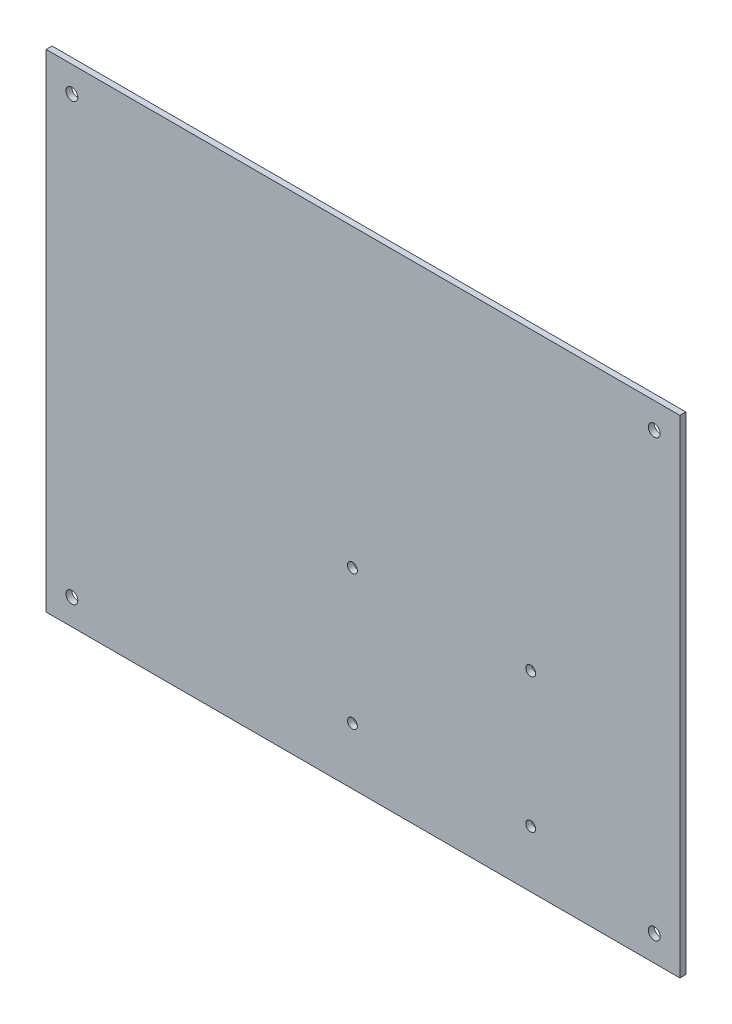
ISO-10303-21;
HEADER;
FILE_DESCRIPTION(('STEP AP214'),'2;1');
FILE_NAME('part.step','',(''),(''),'','','');
FILE_SCHEMA(('AUTOMOTIVE_DESIGN { 1 0 10303 214 1 1 1 1 }'));
ENDSEC;
DATA;
#1=APPLICATION_CONTEXT('core data for automotive mechanical design processes');
#2=APPLICATION_PROTOCOL_DEFINITION('international standard','automotive_design',2000,#1);
#3=PRODUCT_CONTEXT('',#1,'mechanical');
#4=PRODUCT('Part','Part','',(#3));
#5=PRODUCT_RELATED_PRODUCT_CATEGORY('part','',(#4));
#6=PRODUCT_DEFINITION_FORMATION('','',#4);
#7=PRODUCT_DEFINITION_CONTEXT('part definition',#1,'design');
#8=PRODUCT_DEFINITION('design','',#6,#7);
#9=PRODUCT_DEFINITION_SHAPE('','',#8);
#10=(LENGTH_UNIT() NAMED_UNIT(*) SI_UNIT(.MILLI.,.METRE.));
#11=(NAMED_UNIT(*) PLANE_ANGLE_UNIT() SI_UNIT($,.RADIAN.));
#12=(NAMED_UNIT(*) SI_UNIT($,.STERADIAN.) SOLID_ANGLE_UNIT());
#13=UNCERTAINTY_MEASURE_WITH_UNIT(LENGTH_MEASURE(1.E-05),#10,'distance_accuracy_value','');
#14=(GEOMETRIC_REPRESENTATION_CONTEXT(3) GLOBAL_UNCERTAINTY_ASSIGNED_CONTEXT((#13)) GLOBAL_UNIT_ASSIGNED_CONTEXT((#10,
#11,#12)) REPRESENTATION_CONTEXT('',''));
#15=CARTESIAN_POINT('',(0.,0.,0.));
#16=DIRECTION('',(0.,0.,1.));
#17=DIRECTION('',(1.,0.,0.));
#18=AXIS2_PLACEMENT_3D('',#15,#16,#17);
#19=CARTESIAN_POINT('',(1037.34751782577,-1519.02260067621,2.25));
#20=DIRECTION('',(0.,0.,1.));
#21=DIRECTION('',(1.,0.,0.));
#22=AXIS2_PLACEMENT_3D('',#19,#20,#21);
#23=PLANE('',#22);
#24=CARTESIAN_POINT('',(1194.93385313975,-1700.96117964024,2.25));
#25=DIRECTION('',(0.,0.,1.));
#26=DIRECTION('',(1.,0.,0.));
#27=AXIS2_PLACEMENT_3D('',#24,#25,#26);
#28=CIRCLE('',#27,1.25000000000008);
#29=CARTESIAN_POINT('',(1196.18385313975,-1700.96117964024,2.25));
#30=VERTEX_POINT('',#29);
#31=EDGE_CURVE('E126',#30,#30,#28,.T.);
#32=ORIENTED_EDGE('',*,*,#31,.F.);
#33=EDGE_LOOP('',(#32));
#34=FACE_BOUND('',#33,.T.);
#35=CARTESIAN_POINT('',(1194.93385313975,-1734.96117964024,2.25));
#36=DIRECTION('',(0.,0.,1.));
#37=DIRECTION('',(1.,0.,0.));
#38=AXIS2_PLACEMENT_3D('',#35,#36,#37);
#39=CIRCLE('',#38,1.25000000000008);
#40=CARTESIAN_POINT('',(1196.18385313975,-1734.96117964024,2.25));
#41=VERTEX_POINT('',#40);
#42=EDGE_CURVE('E134',#41,#41,#39,.T.);
#43=ORIENTED_EDGE('',*,*,#42,.F.);
#44=EDGE_LOOP('',(#43));
#45=FACE_BOUND('',#44,.T.);
#46=CARTESIAN_POINT('',(1149.93385313975,-1734.96117964024,2.25));
#47=DIRECTION('',(0.,0.,1.));
#48=DIRECTION('',(1.,0.,0.));
#49=AXIS2_PLACEMENT_3D('',#46,#47,#48);
#50=CIRCLE('',#49,1.25000000000008);
#51=CARTESIAN_POINT('',(1151.18385313975,-1734.96117964024,2.25));
#52=VERTEX_POINT('',#51);
#53=EDGE_CURVE('E140',#52,#52,#50,.T.);
#54=ORIENTED_EDGE('',*,*,#53,.F.);
#55=EDGE_LOOP('',(#54));
#56=FACE_BOUND('',#55,.T.);
#57=CARTESIAN_POINT('',(1149.93385313975,-1700.96117964024,2.25));
#58=DIRECTION('',(0.,0.,1.));
#59=DIRECTION('',(1.,0.,0.));
#60=AXIS2_PLACEMENT_3D('',#57,#58,#59);
#61=CIRCLE('',#60,1.25000000000008);
#62=CARTESIAN_POINT('',(1151.18385313975,-1700.96117964024,2.25));
#63=VERTEX_POINT('',#62);
#64=EDGE_CURVE('E242',#63,#63,#61,.T.);
#65=ORIENTED_EDGE('',*,*,#64,.F.);
#66=EDGE_LOOP('',(#65));
#67=FACE_BOUND('',#66,.T.);
#68=CARTESIAN_POINT('',(1079.10835313975,-1742.80288964024,2.25));
#69=DIRECTION('',(0.,0.,1.));
#70=DIRECTION('',(1.,0.,0.));
#71=AXIS2_PLACEMENT_3D('',#68,#69,#70);
#72=CIRCLE('',#71,1.49999999999995);
#73=CARTESIAN_POINT('',(1080.60835313975,-1742.80288964024,2.25));
#74=VERTEX_POINT('',#73);
#75=EDGE_CURVE('E117',#74,#74,#72,.T.);
#76=ORIENTED_EDGE('',*,*,#75,.F.);
#77=EDGE_LOOP('',(#76));
#78=FACE_BOUND('',#77,.T.);
#79=CARTESIAN_POINT('',(1079.10835313975,-1632.80288964024,2.25));
#80=DIRECTION('',(0.,0.,1.));
#81=DIRECTION('',(1.,0.,0.));
#82=AXIS2_PLACEMENT_3D('',#79,#80,#81);
#83=CIRCLE('',#82,1.49999999999995);
#84=CARTESIAN_POINT('',(1080.60835313975,-1632.80288964024,2.25));
#85=VERTEX_POINT('',#84);
#86=EDGE_CURVE('E111',#85,#85,#83,.T.);
#87=ORIENTED_EDGE('',*,*,#86,.F.);
#88=EDGE_LOOP('',(#87));
#89=FACE_BOUND('',#88,.T.);
#90=DIRECTION('',(0.,-1.,0.));
#91=VECTOR('',#90,1.);
#92=CARTESIAN_POINT('',(1072.60835313975,-1626.30288964024,2.25));
#93=LINE('',#92,#91);
#94=CARTESIAN_POINT('',(1072.60835313975,-1626.30288964024,2.25));
#95=VERTEX_POINT('',#94);
#96=CARTESIAN_POINT('',(1072.60835313975,-1749.30288964024,2.25));
#97=VERTEX_POINT('',#96);
#98=EDGE_CURVE('E103',#95,#97,#93,.T.);
#99=ORIENTED_EDGE('',*,*,#98,.T.);
#100=DIRECTION('',(1.,0.,0.));
#101=VECTOR('',#100,1.);
#102=CARTESIAN_POINT('',(1072.60835313975,-1749.30288964024,2.25));
#103=LINE('',#102,#101);
#104=CARTESIAN_POINT('',(1232.60835313975,-1749.30288964024,2.25));
#105=VERTEX_POINT('',#104);
#106=EDGE_CURVE('E152',#97,#105,#103,.T.);
#107=ORIENTED_EDGE('',*,*,#106,.T.);
#108=DIRECTION('',(0.,1.,0.));
#109=VECTOR('',#108,1.);
#110=CARTESIAN_POINT('',(1232.60835313975,-1626.30288964024,2.25));
#111=LINE('',#110,#109);
#112=CARTESIAN_POINT('',(1232.60835313975,-1626.30288964024,2.25));
#113=VERTEX_POINT('',#112);
#114=EDGE_CURVE('E94',#105,#113,#111,.T.);
#115=ORIENTED_EDGE('',*,*,#114,.T.);
#116=DIRECTION('',(-1.,0.,0.));
#117=VECTOR('',#116,1.);
#118=CARTESIAN_POINT('',(1072.60835313975,-1626.30288964024,2.25));
#119=LINE('',#118,#117);
#120=EDGE_CURVE('E59',#113,#95,#119,.T.);
#121=ORIENTED_EDGE('',*,*,#120,.T.);
#122=EDGE_LOOP('',(#99,#107,#115,#121));
#123=FACE_BOUND('',#122,.T.);
#124=CARTESIAN_POINT('',(1226.10835313975,-1742.80288964024,2.25));
#125=DIRECTION('',(0.,0.,1.));
#126=DIRECTION('',(1.,0.,0.));
#127=AXIS2_PLACEMENT_3D('',#124,#125,#126);
#128=CIRCLE('',#127,1.50000000000006);
#129=CARTESIAN_POINT('',(1227.60835313975,-1742.80288964024,2.25));
#130=VERTEX_POINT('',#129);
#131=EDGE_CURVE('E112',#130,#130,#128,.T.);
#132=ORIENTED_EDGE('',*,*,#131,.F.);
#133=EDGE_LOOP('',(#132));
#134=FACE_BOUND('',#133,.T.);
#135=CARTESIAN_POINT('',(1226.10835313975,-1632.80288964024,2.25));
#136=DIRECTION('',(0.,0.,1.));
#137=DIRECTION('',(1.,0.,0.));
#138=AXIS2_PLACEMENT_3D('',#135,#136,#137);
#139=CIRCLE('',#138,1.50000000000006);
#140=CARTESIAN_POINT('',(1227.60835313975,-1632.80288964024,2.25));
#141=VERTEX_POINT('',#140);
#142=EDGE_CURVE('E122',#141,#141,#139,.T.);
#143=ORIENTED_EDGE('',*,*,#142,.F.);
#144=EDGE_LOOP('',(#143));
#145=FACE_BOUND('',#144,.T.);
#146=ADVANCED_FACE('F39',(#34,#45,#56,#67,#78,#89,#123,#134,#145),#23,.T.);
#147=CARTESIAN_POINT('',(1037.34751782577,-1519.02260067621,0.75));
#148=DIRECTION('',(0.,0.,1.));
#149=DIRECTION('',(1.,0.,0.));
#150=AXIS2_PLACEMENT_3D('',#147,#148,#149);
#151=PLANE('',#150);
#152=CARTESIAN_POINT('',(1194.93385313975,-1700.96117964024,0.75));
#153=DIRECTION('',(0.,0.,1.));
#154=DIRECTION('',(1.,0.,0.));
#155=AXIS2_PLACEMENT_3D('',#152,#153,#154);
#156=CIRCLE('',#155,1.25000000000008);
#157=CARTESIAN_POINT('',(1196.18385313975,-1700.96117964024,0.75));
#158=VERTEX_POINT('',#157);
#159=EDGE_CURVE('E245',#158,#158,#156,.T.);
#160=ORIENTED_EDGE('',*,*,#159,.T.);
#161=EDGE_LOOP('',(#160));
#162=FACE_BOUND('',#161,.T.);
#163=CARTESIAN_POINT('',(1194.93385313975,-1734.96117964024,0.75));
#164=DIRECTION('',(0.,0.,1.));
#165=DIRECTION('',(1.,0.,0.));
#166=AXIS2_PLACEMENT_3D('',#163,#164,#165);
#167=CIRCLE('',#166,1.25000000000008);
#168=CARTESIAN_POINT('',(1196.18385313975,-1734.96117964024,0.75));
#169=VERTEX_POINT('',#168);
#170=EDGE_CURVE('E237',#169,#169,#167,.T.);
#171=ORIENTED_EDGE('',*,*,#170,.T.);
#172=EDGE_LOOP('',(#171));
#173=FACE_BOUND('',#172,.T.);
#174=CARTESIAN_POINT('',(1149.93385313975,-1734.96117964024,0.75));
#175=DIRECTION('',(0.,0.,1.));
#176=DIRECTION('',(1.,0.,0.));
#177=AXIS2_PLACEMENT_3D('',#174,#175,#176);
#178=CIRCLE('',#177,1.25000000000008);
#179=CARTESIAN_POINT('',(1151.18385313975,-1734.96117964024,0.75));
#180=VERTEX_POINT('',#179);
#181=EDGE_CURVE('E233',#180,#180,#178,.T.);
#182=ORIENTED_EDGE('',*,*,#181,.T.);
#183=EDGE_LOOP('',(#182));
#184=FACE_BOUND('',#183,.T.);
#185=CARTESIAN_POINT('',(1149.93385313975,-1700.96117964024,0.75));
#186=DIRECTION('',(0.,0.,1.));
#187=DIRECTION('',(1.,0.,0.));
#188=AXIS2_PLACEMENT_3D('',#185,#186,#187);
#189=CIRCLE('',#188,1.25000000000008);
#190=CARTESIAN_POINT('',(1151.18385313975,-1700.96117964024,0.75));
#191=VERTEX_POINT('',#190);
#192=EDGE_CURVE('E236',#191,#191,#189,.T.);
#193=ORIENTED_EDGE('',*,*,#192,.T.);
#194=EDGE_LOOP('',(#193));
#195=FACE_BOUND('',#194,.T.);
#196=DIRECTION('',(0.,-1.,0.));
#197=VECTOR('',#196,1.);
#198=CARTESIAN_POINT('',(1072.60835313975,-1626.30288964024,0.75));
#199=LINE('',#198,#197);
#200=CARTESIAN_POINT('',(1072.60835313975,-1626.30288964024,0.75));
#201=VERTEX_POINT('',#200);
#202=CARTESIAN_POINT('',(1072.60835313975,-1749.30288964024,0.75));
#203=VERTEX_POINT('',#202);
#204=EDGE_CURVE('E88',#201,#203,#199,.T.);
#205=ORIENTED_EDGE('',*,*,#204,.F.);
#206=DIRECTION('',(-1.,0.,0.));
#207=VECTOR('',#206,1.);
#208=CARTESIAN_POINT('',(1072.60835313975,-1626.30288964024,0.75));
#209=LINE('',#208,#207);
#210=CARTESIAN_POINT('',(1232.60835313975,-1626.30288964024,0.75));
#211=VERTEX_POINT('',#210);
#212=EDGE_CURVE('E99',#211,#201,#209,.T.);
#213=ORIENTED_EDGE('',*,*,#212,.F.);
#214=DIRECTION('',(0.,1.,0.));
#215=VECTOR('',#214,1.);
#216=CARTESIAN_POINT('',(1232.60835313975,-1626.30288964024,0.75));
#217=LINE('',#216,#215);
#218=CARTESIAN_POINT('',(1232.60835313975,-1749.30288964024,0.75));
#219=VERTEX_POINT('',#218);
#220=EDGE_CURVE('E87',#219,#211,#217,.T.);
#221=ORIENTED_EDGE('',*,*,#220,.F.);
#222=DIRECTION('',(1.,0.,0.));
#223=VECTOR('',#222,1.);
#224=CARTESIAN_POINT('',(1072.60835313975,-1749.30288964024,0.75));
#225=LINE('',#224,#223);
#226=EDGE_CURVE('E77',#203,#219,#225,.T.);
#227=ORIENTED_EDGE('',*,*,#226,.F.);
#228=EDGE_LOOP('',(#205,#213,#221,#227));
#229=FACE_BOUND('',#228,.T.);
#230=CARTESIAN_POINT('',(1079.10835313975,-1632.80288964024,0.75));
#231=DIRECTION('',(0.,0.,1.));
#232=DIRECTION('',(1.,0.,0.));
#233=AXIS2_PLACEMENT_3D('',#230,#231,#232);
#234=CIRCLE('',#233,1.49999999999995);
#235=CARTESIAN_POINT('',(1080.60835313975,-1632.80288964024,0.75));
#236=VERTEX_POINT('',#235);
#237=EDGE_CURVE('E107',#236,#236,#234,.T.);
#238=ORIENTED_EDGE('',*,*,#237,.T.);
#239=EDGE_LOOP('',(#238));
#240=FACE_BOUND('',#239,.T.);
#241=CARTESIAN_POINT('',(1226.10835313975,-1742.80288964024,0.75));
#242=DIRECTION('',(0.,0.,1.));
#243=DIRECTION('',(1.,0.,0.));
#244=AXIS2_PLACEMENT_3D('',#241,#242,#243);
#245=CIRCLE('',#244,1.50000000000006);
#246=CARTESIAN_POINT('',(1227.60835313975,-1742.80288964024,0.75));
#247=VERTEX_POINT('',#246);
#248=EDGE_CURVE('E113',#247,#247,#245,.T.);
#249=ORIENTED_EDGE('',*,*,#248,.T.);
#250=EDGE_LOOP('',(#249));
#251=FACE_BOUND('',#250,.T.);
#252=CARTESIAN_POINT('',(1079.10835313975,-1742.80288964024,0.75));
#253=DIRECTION('',(0.,0.,1.));
#254=DIRECTION('',(1.,0.,0.));
#255=AXIS2_PLACEMENT_3D('',#252,#253,#254);
#256=CIRCLE('',#255,1.49999999999995);
#257=CARTESIAN_POINT('',(1080.60835313975,-1742.80288964024,0.75));
#258=VERTEX_POINT('',#257);
#259=EDGE_CURVE('E118',#258,#258,#256,.T.);
#260=ORIENTED_EDGE('',*,*,#259,.T.);
#261=EDGE_LOOP('',(#260));
#262=FACE_BOUND('',#261,.T.);
#263=CARTESIAN_POINT('',(1226.10835313975,-1632.80288964024,0.75));
#264=DIRECTION('',(0.,0.,1.));
#265=DIRECTION('',(1.,0.,0.));
#266=AXIS2_PLACEMENT_3D('',#263,#264,#265);
#267=CIRCLE('',#266,1.50000000000006);
#268=CARTESIAN_POINT('',(1227.60835313975,-1632.80288964024,0.75));
#269=VERTEX_POINT('',#268);
#270=EDGE_CURVE('E123',#269,#269,#267,.T.);
#271=ORIENTED_EDGE('',*,*,#270,.T.);
#272=EDGE_LOOP('',(#271));
#273=FACE_BOUND('',#272,.T.);
#274=ADVANCED_FACE('F97',(#162,#173,#184,#195,#229,#240,#251,#262,#273),#151,.F.);
#275=CARTESIAN_POINT('',(1072.60835313975,-1626.30288964024,2.25));
#276=DIRECTION('',(1.,0.,0.));
#277=DIRECTION('',(0.,1.,0.));
#278=AXIS2_PLACEMENT_3D('',#275,#276,#277);
#279=PLANE('',#278);
#280=ORIENTED_EDGE('',*,*,#204,.T.);
#281=DIRECTION('',(0.,0.,-1.));
#282=VECTOR('',#281,1.);
#283=CARTESIAN_POINT('',(1072.60835313975,-1749.30288964024,2.25));
#284=LINE('',#283,#282);
#285=EDGE_CURVE('E11',#97,#203,#284,.T.);
#286=ORIENTED_EDGE('',*,*,#285,.F.);
#287=ORIENTED_EDGE('',*,*,#98,.F.);
#288=DIRECTION('',(0.,0.,-1.));
#289=VECTOR('',#288,1.);
#290=CARTESIAN_POINT('',(1072.60835313975,-1626.30288964024,2.25));
#291=LINE('',#290,#289);
#292=EDGE_CURVE('E160',#95,#201,#291,.T.);
#293=ORIENTED_EDGE('',*,*,#292,.T.);
#294=EDGE_LOOP('',(#280,#286,#287,#293));
#295=FACE_BOUND('',#294,.T.);
#296=ADVANCED_FACE('F172',(#295),#279,.F.);
#297=CARTESIAN_POINT('',(1072.60835313975,-1749.30288964024,2.25));
#298=DIRECTION('',(0.,1.,0.));
#299=DIRECTION('',(0.,0.,1.));
#300=AXIS2_PLACEMENT_3D('',#297,#298,#299);
#301=PLANE('',#300);
#302=ORIENTED_EDGE('',*,*,#226,.T.);
#303=DIRECTION('',(0.,0.,-1.));
#304=VECTOR('',#303,1.);
#305=CARTESIAN_POINT('',(1232.60835313975,-1749.30288964024,2.25));
#306=LINE('',#305,#304);
#307=EDGE_CURVE('E50',#105,#219,#306,.T.);
#308=ORIENTED_EDGE('',*,*,#307,.F.);
#309=ORIENTED_EDGE('',*,*,#106,.F.);
#310=ORIENTED_EDGE('',*,*,#285,.T.);
#311=EDGE_LOOP('',(#302,#308,#309,#310));
#312=FACE_BOUND('',#311,.T.);
#313=ADVANCED_FACE('F81',(#312),#301,.F.);
#314=CARTESIAN_POINT('',(1232.60835313975,-1626.30288964024,2.25));
#315=DIRECTION('',(-1.,0.,0.));
#316=DIRECTION('',(0.,0.,1.));
#317=AXIS2_PLACEMENT_3D('',#314,#315,#316);
#318=PLANE('',#317);
#319=ORIENTED_EDGE('',*,*,#220,.T.);
#320=DIRECTION('',(0.,0.,-1.));
#321=VECTOR('',#320,1.);
#322=CARTESIAN_POINT('',(1232.60835313975,-1626.30288964024,2.25));
#323=LINE('',#322,#321);
#324=EDGE_CURVE('E43',#113,#211,#323,.T.);
#325=ORIENTED_EDGE('',*,*,#324,.F.);
#326=ORIENTED_EDGE('',*,*,#114,.F.);
#327=ORIENTED_EDGE('',*,*,#307,.T.);
#328=EDGE_LOOP('',(#319,#325,#326,#327));
#329=FACE_BOUND('',#328,.T.);
#330=ADVANCED_FACE('F91',(#329),#318,.F.);
#331=CARTESIAN_POINT('',(1072.60835313975,-1626.30288964024,2.25));
#332=DIRECTION('',(0.,-1.,0.));
#333=DIRECTION('',(0.,0.,-1.));
#334=AXIS2_PLACEMENT_3D('',#331,#332,#333);
#335=PLANE('',#334);
#336=ORIENTED_EDGE('',*,*,#212,.T.);
#337=ORIENTED_EDGE('',*,*,#292,.F.);
#338=ORIENTED_EDGE('',*,*,#120,.F.);
#339=ORIENTED_EDGE('',*,*,#324,.T.);
#340=EDGE_LOOP('',(#336,#337,#338,#339));
#341=FACE_BOUND('',#340,.T.);
#342=ADVANCED_FACE('F171',(#341),#335,.F.);
#343=CARTESIAN_POINT('',(1079.10835313975,-1632.80288964024,2.25));
#344=DIRECTION('',(0.,0.,-1.));
#345=DIRECTION('',(-1.,0.,0.));
#346=AXIS2_PLACEMENT_3D('',#343,#344,#345);
#347=CYLINDRICAL_SURFACE('',#346,1.49999999999995);
#348=ORIENTED_EDGE('',*,*,#86,.T.);
#349=EDGE_LOOP('',(#348));
#350=FACE_BOUND('',#349,.T.);
#351=ORIENTED_EDGE('',*,*,#237,.F.);
#352=EDGE_LOOP('',(#351));
#353=FACE_BOUND('',#352,.T.);
#354=ADVANCED_FACE('F198',(#350,#353),#347,.F.);
#355=CARTESIAN_POINT('',(1226.10835313975,-1742.80288964024,2.25));
#356=DIRECTION('',(0.,0.,-1.));
#357=DIRECTION('',(-1.,0.,0.));
#358=AXIS2_PLACEMENT_3D('',#355,#356,#357);
#359=CYLINDRICAL_SURFACE('',#358,1.50000000000006);
#360=ORIENTED_EDGE('',*,*,#131,.T.);
#361=EDGE_LOOP('',(#360));
#362=FACE_BOUND('',#361,.T.);
#363=ORIENTED_EDGE('',*,*,#248,.F.);
#364=EDGE_LOOP('',(#363));
#365=FACE_BOUND('',#364,.T.);
#366=ADVANCED_FACE('F193',(#362,#365),#359,.F.);
#367=CARTESIAN_POINT('',(1079.10835313975,-1742.80288964024,2.25));
#368=DIRECTION('',(0.,0.,-1.));
#369=DIRECTION('',(-1.,0.,0.));
#370=AXIS2_PLACEMENT_3D('',#367,#368,#369);
#371=CYLINDRICAL_SURFACE('',#370,1.49999999999995);
#372=ORIENTED_EDGE('',*,*,#75,.T.);
#373=EDGE_LOOP('',(#372));
#374=FACE_BOUND('',#373,.T.);
#375=ORIENTED_EDGE('',*,*,#259,.F.);
#376=EDGE_LOOP('',(#375));
#377=FACE_BOUND('',#376,.T.);
#378=ADVANCED_FACE('F185',(#374,#377),#371,.F.);
#379=CARTESIAN_POINT('',(1226.10835313975,-1632.80288964024,2.25));
#380=DIRECTION('',(0.,0.,-1.));
#381=DIRECTION('',(-1.,0.,0.));
#382=AXIS2_PLACEMENT_3D('',#379,#380,#381);
#383=CYLINDRICAL_SURFACE('',#382,1.50000000000006);
#384=ORIENTED_EDGE('',*,*,#142,.T.);
#385=EDGE_LOOP('',(#384));
#386=FACE_BOUND('',#385,.T.);
#387=ORIENTED_EDGE('',*,*,#270,.F.);
#388=EDGE_LOOP('',(#387));
#389=FACE_BOUND('',#388,.T.);
#390=ADVANCED_FACE('F41',(#386,#389),#383,.F.);
#391=CARTESIAN_POINT('',(1149.93385313975,-1700.96117964024,0.75));
#392=DIRECTION('',(0.,0.,1.));
#393=DIRECTION('',(1.,0.,0.));
#394=AXIS2_PLACEMENT_3D('',#391,#392,#393);
#395=CYLINDRICAL_SURFACE('',#394,1.25000000000008);
#396=ORIENTED_EDGE('',*,*,#64,.T.);
#397=EDGE_LOOP('',(#396));
#398=FACE_BOUND('',#397,.T.);
#399=ORIENTED_EDGE('',*,*,#192,.F.);
#400=EDGE_LOOP('',(#399));
#401=FACE_BOUND('',#400,.T.);
#402=ADVANCED_FACE('F184',(#398,#401),#395,.F.);
#403=CARTESIAN_POINT('',(1149.93385313975,-1734.96117964024,0.75));
#404=DIRECTION('',(0.,0.,1.));
#405=DIRECTION('',(1.,0.,0.));
#406=AXIS2_PLACEMENT_3D('',#403,#404,#405);
#407=CYLINDRICAL_SURFACE('',#406,1.25000000000008);
#408=ORIENTED_EDGE('',*,*,#53,.T.);
#409=EDGE_LOOP('',(#408));
#410=FACE_BOUND('',#409,.T.);
#411=ORIENTED_EDGE('',*,*,#181,.F.);
#412=EDGE_LOOP('',(#411));
#413=FACE_BOUND('',#412,.T.);
#414=ADVANCED_FACE('F190',(#410,#413),#407,.F.);
#415=CARTESIAN_POINT('',(1194.93385313975,-1734.96117964024,0.75));
#416=DIRECTION('',(0.,0.,1.));
#417=DIRECTION('',(1.,0.,0.));
#418=AXIS2_PLACEMENT_3D('',#415,#416,#417);
#419=CYLINDRICAL_SURFACE('',#418,1.25000000000008);
#420=ORIENTED_EDGE('',*,*,#42,.T.);
#421=EDGE_LOOP('',(#420));
#422=FACE_BOUND('',#421,.T.);
#423=ORIENTED_EDGE('',*,*,#170,.F.);
#424=EDGE_LOOP('',(#423));
#425=FACE_BOUND('',#424,.T.);
#426=ADVANCED_FACE('F220',(#422,#425),#419,.F.);
#427=CARTESIAN_POINT('',(1194.93385313975,-1700.96117964024,0.75));
#428=DIRECTION('',(0.,0.,1.));
#429=DIRECTION('',(1.,0.,0.));
#430=AXIS2_PLACEMENT_3D('',#427,#428,#429);
#431=CYLINDRICAL_SURFACE('',#430,1.25000000000008);
#432=ORIENTED_EDGE('',*,*,#31,.T.);
#433=EDGE_LOOP('',(#432));
#434=FACE_BOUND('',#433,.T.);
#435=ORIENTED_EDGE('',*,*,#159,.F.);
#436=EDGE_LOOP('',(#435));
#437=FACE_BOUND('',#436,.T.);
#438=ADVANCED_FACE('F217',(#434,#437),#431,.F.);
#439=CLOSED_SHELL('',(#146,#274,#296,#313,#330,#342,#354,#366,#378,#390,#402,#414,#426,#438));
#440=MANIFOLD_SOLID_BREP('B2',#439);
#441=ADVANCED_BREP_SHAPE_REPRESENTATION('',(#18,#440),#14);
#442=SHAPE_DEFINITION_REPRESENTATION(#9,#441);
ENDSEC;
END-ISO-10303-21;
